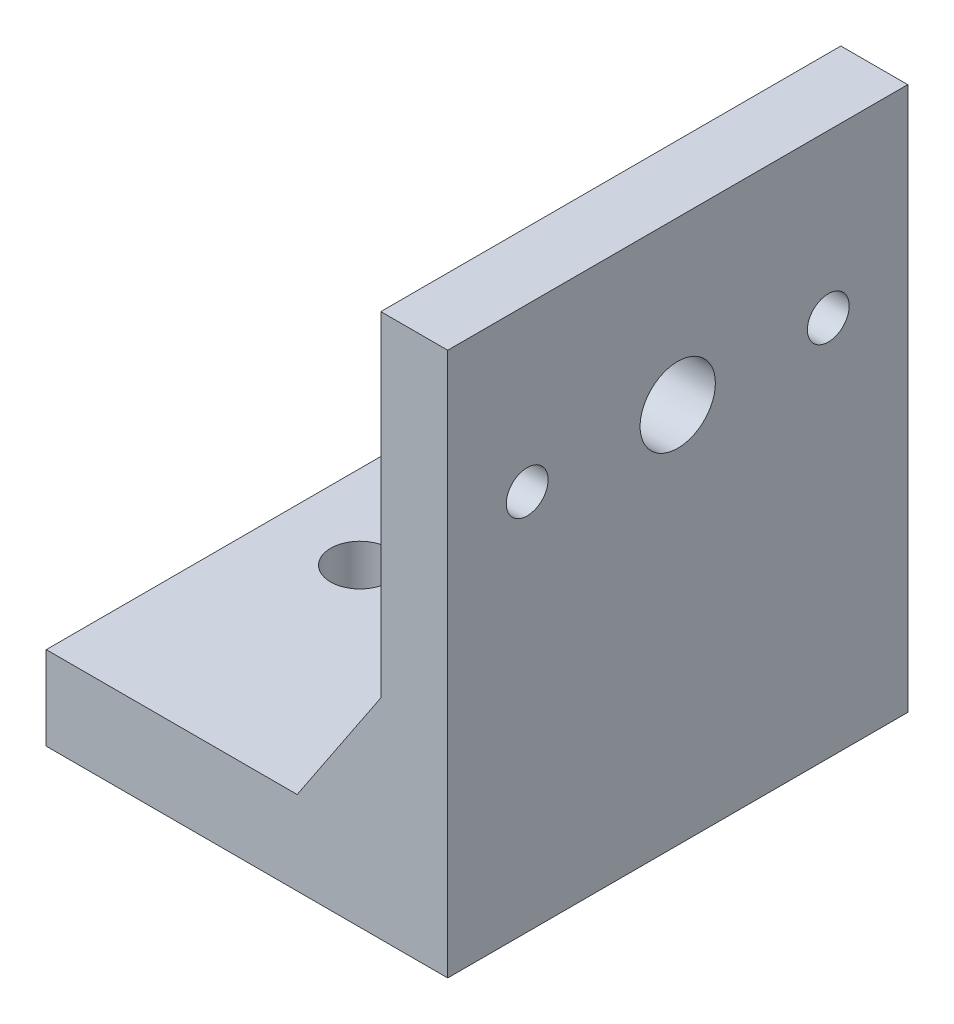
ISO-10303-21;
HEADER;
FILE_DESCRIPTION(('STEP AP214'),'2;1');
FILE_NAME('part.step','',(''),(''),'','','');
FILE_SCHEMA(('AUTOMOTIVE_DESIGN { 1 0 10303 214 1 1 1 1 }'));
ENDSEC;
DATA;
#1=APPLICATION_CONTEXT('core data for automotive mechanical design processes');
#2=APPLICATION_PROTOCOL_DEFINITION('international standard','automotive_design',2000,#1);
#3=PRODUCT_CONTEXT('',#1,'mechanical');
#4=PRODUCT('Part','Part','',(#3));
#5=PRODUCT_RELATED_PRODUCT_CATEGORY('part','',(#4));
#6=PRODUCT_DEFINITION_FORMATION('','',#4);
#7=PRODUCT_DEFINITION_CONTEXT('part definition',#1,'design');
#8=PRODUCT_DEFINITION('design','',#6,#7);
#9=PRODUCT_DEFINITION_SHAPE('','',#8);
#10=(LENGTH_UNIT() NAMED_UNIT(*) SI_UNIT(.MILLI.,.METRE.));
#11=(NAMED_UNIT(*) PLANE_ANGLE_UNIT() SI_UNIT($,.RADIAN.));
#12=(NAMED_UNIT(*) SI_UNIT($,.STERADIAN.) SOLID_ANGLE_UNIT());
#13=UNCERTAINTY_MEASURE_WITH_UNIT(LENGTH_MEASURE(1.E-05),#10,'distance_accuracy_value','');
#14=(GEOMETRIC_REPRESENTATION_CONTEXT(3) GLOBAL_UNCERTAINTY_ASSIGNED_CONTEXT((#13)) GLOBAL_UNIT_ASSIGNED_CONTEXT((#10,
#11,#12)) REPRESENTATION_CONTEXT('',''));
#15=CARTESIAN_POINT('',(0.,0.,0.));
#16=DIRECTION('',(0.,0.,1.));
#17=DIRECTION('',(1.,0.,0.));
#18=AXIS2_PLACEMENT_3D('',#15,#16,#17);
#19=CARTESIAN_POINT('',(0.,10.,0.));
#20=DIRECTION('',(0.,1.,0.));
#21=DIRECTION('',(0.,0.,1.));
#22=AXIS2_PLACEMENT_3D('',#19,#20,#21);
#23=PLANE('',#22);
#24=CARTESIAN_POINT('',(-14.,10.,0.));
#25=DIRECTION('',(0.,1.,0.));
#26=DIRECTION('',(0.,0.,1.));
#27=AXIS2_PLACEMENT_3D('',#24,#25,#26);
#28=CIRCLE('',#27,3.5);
#29=CARTESIAN_POINT('',(-14.,10.,3.5));
#30=VERTEX_POINT('',#29);
#31=EDGE_CURVE('E162',#30,#30,#28,.F.);
#32=ORIENTED_EDGE('',*,*,#31,.T.);
#33=EDGE_LOOP('',(#32));
#34=FACE_BOUND('',#33,.T.);
#35=CARTESIAN_POINT('',(4.,10.,0.));
#36=DIRECTION('',(0.,1.,0.));
#37=DIRECTION('',(0.,0.,1.));
#38=AXIS2_PLACEMENT_3D('',#35,#36,#37);
#39=CIRCLE('',#38,3.5);
#40=CARTESIAN_POINT('',(4.,10.,3.5));
#41=VERTEX_POINT('',#40);
#42=EDGE_CURVE('E157',#41,#41,#39,.F.);
#43=ORIENTED_EDGE('',*,*,#42,.T.);
#44=EDGE_LOOP('',(#43));
#45=FACE_BOUND('',#44,.T.);
#46=DIRECTION('',(1.,0.,0.));
#47=VECTOR('',#46,1.);
#48=CARTESIAN_POINT('',(-24.,10.,27.5));
#49=LINE('',#48,#47);
#50=CARTESIAN_POINT('',(-24.,10.,27.5));
#51=VERTEX_POINT('',#50);
#52=CARTESIAN_POINT('',(6.,10.,27.5));
#53=VERTEX_POINT('',#52);
#54=EDGE_CURVE('E133',#51,#53,#49,.T.);
#55=ORIENTED_EDGE('',*,*,#54,.T.);
#56=DIRECTION('',(0.,0.,1.));
#57=VECTOR('',#56,1.);
#58=CARTESIAN_POINT('',(6.,10.,22.5));
#59=LINE('',#58,#57);
#60=CARTESIAN_POINT('',(6.,10.,22.5));
#61=VERTEX_POINT('',#60);
#62=EDGE_CURVE('E125',#61,#53,#59,.T.);
#63=ORIENTED_EDGE('',*,*,#62,.F.);
#64=DIRECTION('',(-1.,0.,0.));
#65=VECTOR('',#64,1.);
#66=CARTESIAN_POINT('',(16.,10.,22.5));
#67=LINE('',#66,#65);
#68=CARTESIAN_POINT('',(16.,10.,22.5));
#69=VERTEX_POINT('',#68);
#70=EDGE_CURVE('E113',#69,#61,#67,.T.);
#71=ORIENTED_EDGE('',*,*,#70,.F.);
#72=DIRECTION('',(0.,0.,-1.));
#73=VECTOR('',#72,1.);
#74=CARTESIAN_POINT('',(16.,10.,0.));
#75=LINE('',#74,#73);
#76=CARTESIAN_POINT('',(16.,10.,-22.5));
#77=VERTEX_POINT('',#76);
#78=EDGE_CURVE('E191',#69,#77,#75,.T.);
#79=ORIENTED_EDGE('',*,*,#78,.T.);
#80=DIRECTION('',(-1.,0.,0.));
#81=VECTOR('',#80,1.);
#82=CARTESIAN_POINT('',(16.,10.,-22.5));
#83=LINE('',#82,#81);
#84=CARTESIAN_POINT('',(6.,10.,-22.5));
#85=VERTEX_POINT('',#84);
#86=EDGE_CURVE('E54',#77,#85,#83,.T.);
#87=ORIENTED_EDGE('',*,*,#86,.T.);
#88=DIRECTION('',(0.,0.,-1.));
#89=VECTOR('',#88,1.);
#90=CARTESIAN_POINT('',(6.,10.,-22.5));
#91=LINE('',#90,#89);
#92=CARTESIAN_POINT('',(6.,10.,-27.5));
#93=VERTEX_POINT('',#92);
#94=EDGE_CURVE('E58',#85,#93,#91,.T.);
#95=ORIENTED_EDGE('',*,*,#94,.T.);
#96=DIRECTION('',(-1.,0.,0.));
#97=VECTOR('',#96,1.);
#98=CARTESIAN_POINT('',(-24.,10.,-27.5));
#99=LINE('',#98,#97);
#100=CARTESIAN_POINT('',(-24.,10.,-27.5));
#101=VERTEX_POINT('',#100);
#102=EDGE_CURVE('E194',#93,#101,#99,.T.);
#103=ORIENTED_EDGE('',*,*,#102,.T.);
#104=DIRECTION('',(0.,0.,1.));
#105=VECTOR('',#104,1.);
#106=CARTESIAN_POINT('',(-24.,10.,-27.5));
#107=LINE('',#106,#105);
#108=EDGE_CURVE('E196',#101,#51,#107,.T.);
#109=ORIENTED_EDGE('',*,*,#108,.T.);
#110=EDGE_LOOP('',(#55,#63,#71,#79,#87,#95,#103,#109));
#111=FACE_BOUND('',#110,.T.);
#112=ADVANCED_FACE('F37',(#34,#45,#111),#23,.T.);
#113=CARTESIAN_POINT('',(16.,65.,-27.5));
#114=DIRECTION('',(1.,0.,0.));
#115=DIRECTION('',(0.,0.,-1.));
#116=AXIS2_PLACEMENT_3D('',#113,#114,#115);
#117=PLANE('',#116);
#118=CARTESIAN_POINT('',(16.,45.6,0.));
#119=DIRECTION('',(1.,0.,0.));
#120=DIRECTION('',(0.,0.,-1.));
#121=AXIS2_PLACEMENT_3D('',#118,#119,#120);
#122=CIRCLE('',#121,4.5);
#123=CARTESIAN_POINT('',(16.,45.6,-4.5));
#124=VERTEX_POINT('',#123);
#125=EDGE_CURVE('E175',#124,#124,#122,.T.);
#126=ORIENTED_EDGE('',*,*,#125,.T.);
#127=EDGE_LOOP('',(#126));
#128=FACE_BOUND('',#127,.T.);
#129=CARTESIAN_POINT('',(16.,45.6,-18.));
#130=DIRECTION('',(1.,0.,0.));
#131=DIRECTION('',(0.,0.,-1.));
#132=AXIS2_PLACEMENT_3D('',#129,#130,#131);
#133=CIRCLE('',#132,2.5);
#134=CARTESIAN_POINT('',(16.,45.6,-20.5));
#135=VERTEX_POINT('',#134);
#136=EDGE_CURVE('E169',#135,#135,#133,.T.);
#137=ORIENTED_EDGE('',*,*,#136,.T.);
#138=EDGE_LOOP('',(#137));
#139=FACE_BOUND('',#138,.T.);
#140=CARTESIAN_POINT('',(16.,45.6,18.));
#141=DIRECTION('',(1.,0.,0.));
#142=DIRECTION('',(0.,0.,-1.));
#143=AXIS2_PLACEMENT_3D('',#140,#141,#142);
#144=CIRCLE('',#143,2.5);
#145=CARTESIAN_POINT('',(16.,45.6,15.5));
#146=VERTEX_POINT('',#145);
#147=EDGE_CURVE('E41',#146,#146,#144,.T.);
#148=ORIENTED_EDGE('',*,*,#147,.T.);
#149=EDGE_LOOP('',(#148));
#150=FACE_BOUND('',#149,.T.);
#151=DIRECTION('',(0.,0.,1.));
#152=VECTOR('',#151,1.);
#153=CARTESIAN_POINT('',(16.,25.,22.5));
#154=LINE('',#153,#152);
#155=CARTESIAN_POINT('',(16.,25.,22.5));
#156=VERTEX_POINT('',#155);
#157=CARTESIAN_POINT('',(16.,25.,27.5));
#158=VERTEX_POINT('',#157);
#159=EDGE_CURVE('E128',#156,#158,#154,.T.);
#160=ORIENTED_EDGE('',*,*,#159,.T.);
#161=DIRECTION('',(0.,-1.,0.));
#162=VECTOR('',#161,1.);
#163=CARTESIAN_POINT('',(16.,65.,27.5));
#164=LINE('',#163,#162);
#165=CARTESIAN_POINT('',(16.,65.,27.5));
#166=VERTEX_POINT('',#165);
#167=EDGE_CURVE('E186',#166,#158,#164,.T.);
#168=ORIENTED_EDGE('',*,*,#167,.F.);
#169=DIRECTION('',(0.,0.,1.));
#170=VECTOR('',#169,1.);
#171=CARTESIAN_POINT('',(16.,65.,-27.5));
#172=LINE('',#171,#170);
#173=CARTESIAN_POINT('',(16.,65.,-27.5));
#174=VERTEX_POINT('',#173);
#175=EDGE_CURVE('E181',#174,#166,#172,.T.);
#176=ORIENTED_EDGE('',*,*,#175,.F.);
#177=DIRECTION('',(0.,-1.,0.));
#178=VECTOR('',#177,1.);
#179=CARTESIAN_POINT('',(16.,65.,-27.5));
#180=LINE('',#179,#178);
#181=CARTESIAN_POINT('',(16.,25.,-27.5));
#182=VERTEX_POINT('',#181);
#183=EDGE_CURVE('E189',#174,#182,#180,.T.);
#184=ORIENTED_EDGE('',*,*,#183,.T.);
#185=DIRECTION('',(0.,0.,-1.));
#186=VECTOR('',#185,1.);
#187=CARTESIAN_POINT('',(16.,25.,-22.5));
#188=LINE('',#187,#186);
#189=CARTESIAN_POINT('',(16.,25.,-22.5));
#190=VERTEX_POINT('',#189);
#191=EDGE_CURVE('E147',#190,#182,#188,.T.);
#192=ORIENTED_EDGE('',*,*,#191,.F.);
#193=DIRECTION('',(0.,-1.,0.));
#194=VECTOR('',#193,1.);
#195=CARTESIAN_POINT('',(16.,25.,-22.5));
#196=LINE('',#195,#194);
#197=EDGE_CURVE('E143',#190,#77,#196,.T.);
#198=ORIENTED_EDGE('',*,*,#197,.T.);
#199=ORIENTED_EDGE('',*,*,#78,.F.);
#200=DIRECTION('',(0.,-1.,0.));
#201=VECTOR('',#200,1.);
#202=CARTESIAN_POINT('',(16.,25.,22.5));
#203=LINE('',#202,#201);
#204=EDGE_CURVE('E119',#156,#69,#203,.T.);
#205=ORIENTED_EDGE('',*,*,#204,.F.);
#206=EDGE_LOOP('',(#160,#168,#176,#184,#192,#198,#199,#205));
#207=FACE_BOUND('',#206,.T.);
#208=ADVANCED_FACE('F222',(#128,#139,#150,#207),#117,.F.);
#209=CARTESIAN_POINT('',(24.,10.,-27.5));
#210=DIRECTION('',(-1.,0.,0.));
#211=DIRECTION('',(0.,0.,1.));
#212=AXIS2_PLACEMENT_3D('',#209,#210,#211);
#213=PLANE('',#212);
#214=CARTESIAN_POINT('',(24.,45.6,18.));
#215=DIRECTION('',(1.,0.,0.));
#216=DIRECTION('',(0.,0.,-1.));
#217=AXIS2_PLACEMENT_3D('',#214,#215,#216);
#218=CIRCLE('',#217,2.5);
#219=CARTESIAN_POINT('',(24.,45.6,15.5));
#220=VERTEX_POINT('',#219);
#221=EDGE_CURVE('E166',#220,#220,#218,.T.);
#222=ORIENTED_EDGE('',*,*,#221,.F.);
#223=EDGE_LOOP('',(#222));
#224=FACE_BOUND('',#223,.T.);
#225=CARTESIAN_POINT('',(24.,45.6,-18.));
#226=DIRECTION('',(1.,0.,0.));
#227=DIRECTION('',(0.,0.,1.));
#228=AXIS2_PLACEMENT_3D('',#225,#226,#227);
#229=CIRCLE('',#228,2.5);
#230=CARTESIAN_POINT('',(24.,45.6,-15.5));
#231=VERTEX_POINT('',#230);
#232=EDGE_CURVE('E165',#231,#231,#229,.T.);
#233=ORIENTED_EDGE('',*,*,#232,.F.);
#234=EDGE_LOOP('',(#233));
#235=FACE_BOUND('',#234,.T.);
#236=CARTESIAN_POINT('',(24.,45.6,0.));
#237=DIRECTION('',(1.,0.,0.));
#238=DIRECTION('',(0.,0.,-1.));
#239=AXIS2_PLACEMENT_3D('',#236,#237,#238);
#240=CIRCLE('',#239,4.5);
#241=CARTESIAN_POINT('',(24.,45.6,-4.5));
#242=VERTEX_POINT('',#241);
#243=EDGE_CURVE('E172',#242,#242,#240,.T.);
#244=ORIENTED_EDGE('',*,*,#243,.F.);
#245=EDGE_LOOP('',(#244));
#246=FACE_BOUND('',#245,.T.);
#247=DIRECTION('',(0.,0.,-1.));
#248=VECTOR('',#247,1.);
#249=CARTESIAN_POINT('',(24.,0.,-27.5));
#250=LINE('',#249,#248);
#251=CARTESIAN_POINT('',(24.,0.,27.5));
#252=VERTEX_POINT('',#251);
#253=CARTESIAN_POINT('',(24.,0.,-27.5));
#254=VERTEX_POINT('',#253);
#255=EDGE_CURVE('E193',#252,#254,#250,.T.);
#256=ORIENTED_EDGE('',*,*,#255,.T.);
#257=DIRECTION('',(0.,-1.,0.));
#258=VECTOR('',#257,1.);
#259=CARTESIAN_POINT('',(24.,10.,-27.5));
#260=LINE('',#259,#258);
#261=CARTESIAN_POINT('',(24.,65.,-27.5));
#262=VERTEX_POINT('',#261);
#263=EDGE_CURVE('E11',#262,#254,#260,.T.);
#264=ORIENTED_EDGE('',*,*,#263,.F.);
#265=DIRECTION('',(0.,0.,-1.));
#266=VECTOR('',#265,1.);
#267=CARTESIAN_POINT('',(24.,65.,-27.5));
#268=LINE('',#267,#266);
#269=CARTESIAN_POINT('',(24.,65.,27.5));
#270=VERTEX_POINT('',#269);
#271=EDGE_CURVE('E176',#270,#262,#268,.T.);
#272=ORIENTED_EDGE('',*,*,#271,.F.);
#273=DIRECTION('',(0.,-1.,0.));
#274=VECTOR('',#273,1.);
#275=CARTESIAN_POINT('',(24.,10.,27.5));
#276=LINE('',#275,#274);
#277=EDGE_CURVE('E200',#270,#252,#276,.T.);
#278=ORIENTED_EDGE('',*,*,#277,.T.);
#279=EDGE_LOOP('',(#256,#264,#272,#278));
#280=FACE_BOUND('',#279,.T.);
#281=ADVANCED_FACE('F39',(#224,#235,#246,#280),#213,.F.);
#282=CARTESIAN_POINT('',(-24.,10.,-27.5));
#283=DIRECTION('',(0.,0.,1.));
#284=DIRECTION('',(1.,0.,0.));
#285=AXIS2_PLACEMENT_3D('',#282,#283,#284);
#286=PLANE('',#285);
#287=ORIENTED_EDGE('',*,*,#102,.F.);
#288=DIRECTION('',(0.554700196225229,0.832050294337844,0.));
#289=VECTOR('',#288,1.);
#290=CARTESIAN_POINT('',(16.,25.,-27.5));
#291=LINE('',#290,#289);
#292=EDGE_CURVE('E135',#93,#182,#291,.T.);
#293=ORIENTED_EDGE('',*,*,#292,.T.);
#294=ORIENTED_EDGE('',*,*,#183,.F.);
#295=DIRECTION('',(-1.,0.,0.));
#296=VECTOR('',#295,1.);
#297=CARTESIAN_POINT('',(24.,65.,-27.5));
#298=LINE('',#297,#296);
#299=EDGE_CURVE('E179',#262,#174,#298,.T.);
#300=ORIENTED_EDGE('',*,*,#299,.F.);
#301=ORIENTED_EDGE('',*,*,#263,.T.);
#302=DIRECTION('',(-1.,0.,0.));
#303=VECTOR('',#302,1.);
#304=CARTESIAN_POINT('',(-24.,0.,-27.5));
#305=LINE('',#304,#303);
#306=CARTESIAN_POINT('',(-24.,0.,-27.5));
#307=VERTEX_POINT('',#306);
#308=EDGE_CURVE('E203',#254,#307,#305,.T.);
#309=ORIENTED_EDGE('',*,*,#308,.T.);
#310=DIRECTION('',(0.,-1.,0.));
#311=VECTOR('',#310,1.);
#312=CARTESIAN_POINT('',(-24.,10.,-27.5));
#313=LINE('',#312,#311);
#314=EDGE_CURVE('E46',#101,#307,#313,.T.);
#315=ORIENTED_EDGE('',*,*,#314,.F.);
#316=EDGE_LOOP('',(#287,#293,#294,#300,#301,#309,#315));
#317=FACE_BOUND('',#316,.T.);
#318=ADVANCED_FACE('F263',(#317),#286,.F.);
#319=CARTESIAN_POINT('',(-24.,10.,-27.5));
#320=DIRECTION('',(1.,0.,0.));
#321=DIRECTION('',(0.,0.,-1.));
#322=AXIS2_PLACEMENT_3D('',#319,#320,#321);
#323=PLANE('',#322);
#324=DIRECTION('',(0.,0.,1.));
#325=VECTOR('',#324,1.);
#326=CARTESIAN_POINT('',(-24.,0.,-27.5));
#327=LINE('',#326,#325);
#328=CARTESIAN_POINT('',(-24.,0.,27.5));
#329=VERTEX_POINT('',#328);
#330=EDGE_CURVE('E205',#307,#329,#327,.T.);
#331=ORIENTED_EDGE('',*,*,#330,.T.);
#332=DIRECTION('',(0.,-1.,0.));
#333=VECTOR('',#332,1.);
#334=CARTESIAN_POINT('',(-24.,10.,27.5));
#335=LINE('',#334,#333);
#336=EDGE_CURVE('E210',#51,#329,#335,.T.);
#337=ORIENTED_EDGE('',*,*,#336,.F.);
#338=ORIENTED_EDGE('',*,*,#108,.F.);
#339=ORIENTED_EDGE('',*,*,#314,.T.);
#340=EDGE_LOOP('',(#331,#337,#338,#339));
#341=FACE_BOUND('',#340,.T.);
#342=ADVANCED_FACE('F260',(#341),#323,.F.);
#343=CARTESIAN_POINT('',(-24.,10.,27.5));
#344=DIRECTION('',(0.,0.,-1.));
#345=DIRECTION('',(-1.,0.,0.));
#346=AXIS2_PLACEMENT_3D('',#343,#344,#345);
#347=PLANE('',#346);
#348=DIRECTION('',(0.554700196225229,0.832050294337844,0.));
#349=VECTOR('',#348,1.);
#350=CARTESIAN_POINT('',(16.,25.,27.5));
#351=LINE('',#350,#349);
#352=EDGE_CURVE('E129',#53,#158,#351,.T.);
#353=ORIENTED_EDGE('',*,*,#352,.F.);
#354=ORIENTED_EDGE('',*,*,#54,.F.);
#355=ORIENTED_EDGE('',*,*,#336,.T.);
#356=DIRECTION('',(1.,0.,0.));
#357=VECTOR('',#356,1.);
#358=CARTESIAN_POINT('',(-24.,0.,27.5));
#359=LINE('',#358,#357);
#360=EDGE_CURVE('E197',#329,#252,#359,.T.);
#361=ORIENTED_EDGE('',*,*,#360,.T.);
#362=ORIENTED_EDGE('',*,*,#277,.F.);
#363=DIRECTION('',(1.,0.,0.));
#364=VECTOR('',#363,1.);
#365=CARTESIAN_POINT('',(24.,65.,27.5));
#366=LINE('',#365,#364);
#367=EDGE_CURVE('E183',#166,#270,#366,.T.);
#368=ORIENTED_EDGE('',*,*,#367,.F.);
#369=ORIENTED_EDGE('',*,*,#167,.T.);
#370=EDGE_LOOP('',(#353,#354,#355,#361,#362,#368,#369));
#371=FACE_BOUND('',#370,.T.);
#372=ADVANCED_FACE('F256',(#371),#347,.F.);
#373=CARTESIAN_POINT('',(0.,0.,0.));
#374=DIRECTION('',(0.,1.,0.));
#375=DIRECTION('',(0.,0.,1.));
#376=AXIS2_PLACEMENT_3D('',#373,#374,#375);
#377=PLANE('',#376);
#378=CARTESIAN_POINT('',(-14.,0.,0.));
#379=DIRECTION('',(0.,1.,0.));
#380=DIRECTION('',(0.,0.,1.));
#381=AXIS2_PLACEMENT_3D('',#378,#379,#380);
#382=CIRCLE('',#381,3.5);
#383=CARTESIAN_POINT('',(-14.,0.,3.5));
#384=VERTEX_POINT('',#383);
#385=EDGE_CURVE('E154',#384,#384,#382,.T.);
#386=ORIENTED_EDGE('',*,*,#385,.T.);
#387=EDGE_LOOP('',(#386));
#388=FACE_BOUND('',#387,.T.);
#389=CARTESIAN_POINT('',(4.,0.,0.));
#390=DIRECTION('',(0.,1.,0.));
#391=DIRECTION('',(0.,0.,1.));
#392=AXIS2_PLACEMENT_3D('',#389,#390,#391);
#393=CIRCLE('',#392,3.5);
#394=CARTESIAN_POINT('',(4.,0.,3.5));
#395=VERTEX_POINT('',#394);
#396=EDGE_CURVE('E151',#395,#395,#393,.T.);
#397=ORIENTED_EDGE('',*,*,#396,.T.);
#398=EDGE_LOOP('',(#397));
#399=FACE_BOUND('',#398,.T.);
#400=ORIENTED_EDGE('',*,*,#255,.F.);
#401=ORIENTED_EDGE('',*,*,#360,.F.);
#402=ORIENTED_EDGE('',*,*,#330,.F.);
#403=ORIENTED_EDGE('',*,*,#308,.F.);
#404=EDGE_LOOP('',(#400,#401,#402,#403));
#405=FACE_BOUND('',#404,.T.);
#406=ADVANCED_FACE('F252',(#388,#399,#405),#377,.F.);
#407=CARTESIAN_POINT('',(0.,65.,0.));
#408=DIRECTION('',(0.,-1.,0.));
#409=DIRECTION('',(0.,0.,-1.));
#410=AXIS2_PLACEMENT_3D('',#407,#408,#409);
#411=PLANE('',#410);
#412=ORIENTED_EDGE('',*,*,#271,.T.);
#413=ORIENTED_EDGE('',*,*,#299,.T.);
#414=ORIENTED_EDGE('',*,*,#175,.T.);
#415=ORIENTED_EDGE('',*,*,#367,.T.);
#416=EDGE_LOOP('',(#412,#413,#414,#415));
#417=FACE_BOUND('',#416,.T.);
#418=ADVANCED_FACE('F255',(#417),#411,.F.);
#419=CARTESIAN_POINT('',(-41.,45.6,0.));
#420=DIRECTION('',(1.,0.,0.));
#421=DIRECTION('',(0.,0.,-1.));
#422=AXIS2_PLACEMENT_3D('',#419,#420,#421);
#423=CYLINDRICAL_SURFACE('',#422,4.5);
#424=ORIENTED_EDGE('',*,*,#243,.T.);
#425=EDGE_LOOP('',(#424));
#426=FACE_BOUND('',#425,.T.);
#427=ORIENTED_EDGE('',*,*,#125,.F.);
#428=EDGE_LOOP('',(#427));
#429=FACE_BOUND('',#428,.T.);
#430=ADVANCED_FACE('F238',(#426,#429),#423,.F.);
#431=CARTESIAN_POINT('',(-41.,45.6,-18.));
#432=DIRECTION('',(1.,0.,0.));
#433=DIRECTION('',(0.,0.,-1.));
#434=AXIS2_PLACEMENT_3D('',#431,#432,#433);
#435=CYLINDRICAL_SURFACE('',#434,2.5);
#436=ORIENTED_EDGE('',*,*,#232,.T.);
#437=EDGE_LOOP('',(#436));
#438=FACE_BOUND('',#437,.T.);
#439=ORIENTED_EDGE('',*,*,#136,.F.);
#440=EDGE_LOOP('',(#439));
#441=FACE_BOUND('',#440,.T.);
#442=ADVANCED_FACE('F228',(#438,#441),#435,.F.);
#443=CARTESIAN_POINT('',(-41.,45.6,18.));
#444=DIRECTION('',(1.,0.,0.));
#445=DIRECTION('',(0.,0.,-1.));
#446=AXIS2_PLACEMENT_3D('',#443,#444,#445);
#447=CYLINDRICAL_SURFACE('',#446,2.5);
#448=ORIENTED_EDGE('',*,*,#221,.T.);
#449=EDGE_LOOP('',(#448));
#450=FACE_BOUND('',#449,.T.);
#451=ORIENTED_EDGE('',*,*,#147,.F.);
#452=EDGE_LOOP('',(#451));
#453=FACE_BOUND('',#452,.T.);
#454=ADVANCED_FACE('F225',(#450,#453),#447,.F.);
#455=CARTESIAN_POINT('',(4.,65.,0.));
#456=DIRECTION('',(0.,-1.,0.));
#457=DIRECTION('',(0.,0.,-1.));
#458=AXIS2_PLACEMENT_3D('',#455,#456,#457);
#459=CYLINDRICAL_SURFACE('',#458,3.5);
#460=ORIENTED_EDGE('',*,*,#42,.F.);
#461=EDGE_LOOP('',(#460));
#462=FACE_BOUND('',#461,.T.);
#463=ORIENTED_EDGE('',*,*,#396,.F.);
#464=EDGE_LOOP('',(#463));
#465=FACE_BOUND('',#464,.T.);
#466=ADVANCED_FACE('F227',(#462,#465),#459,.F.);
#467=CARTESIAN_POINT('',(-14.,65.,0.));
#468=DIRECTION('',(0.,-1.,0.));
#469=DIRECTION('',(0.,0.,-1.));
#470=AXIS2_PLACEMENT_3D('',#467,#468,#469);
#471=CYLINDRICAL_SURFACE('',#470,3.5);
#472=ORIENTED_EDGE('',*,*,#31,.F.);
#473=EDGE_LOOP('',(#472));
#474=FACE_BOUND('',#473,.T.);
#475=ORIENTED_EDGE('',*,*,#385,.F.);
#476=EDGE_LOOP('',(#475));
#477=FACE_BOUND('',#476,.T.);
#478=ADVANCED_FACE('F235',(#474,#477),#471,.F.);
#479=CARTESIAN_POINT('',(16.,25.,-22.5));
#480=DIRECTION('',(-0.832050294337844,0.554700196225229,0.));
#481=DIRECTION('',(-0.554700196225229,-0.832050294337844,0.));
#482=AXIS2_PLACEMENT_3D('',#479,#480,#481);
#483=PLANE('',#482);
#484=ORIENTED_EDGE('',*,*,#292,.F.);
#485=ORIENTED_EDGE('',*,*,#94,.F.);
#486=DIRECTION('',(0.554700196225229,0.832050294337844,0.));
#487=VECTOR('',#486,1.);
#488=CARTESIAN_POINT('',(16.,25.,-22.5));
#489=LINE('',#488,#487);
#490=EDGE_CURVE('E140',#85,#190,#489,.T.);
#491=ORIENTED_EDGE('',*,*,#490,.T.);
#492=ORIENTED_EDGE('',*,*,#191,.T.);
#493=EDGE_LOOP('',(#484,#485,#491,#492));
#494=FACE_BOUND('',#493,.T.);
#495=ADVANCED_FACE('F276',(#494),#483,.T.);
#496=CARTESIAN_POINT('',(0.,0.,-22.5));
#497=DIRECTION('',(0.,0.,-1.));
#498=DIRECTION('',(-1.,0.,0.));
#499=AXIS2_PLACEMENT_3D('',#496,#497,#498);
#500=PLANE('',#499);
#501=ORIENTED_EDGE('',*,*,#490,.F.);
#502=ORIENTED_EDGE('',*,*,#86,.F.);
#503=ORIENTED_EDGE('',*,*,#197,.F.);
#504=EDGE_LOOP('',(#501,#502,#503));
#505=FACE_BOUND('',#504,.T.);
#506=ADVANCED_FACE('F281',(#505),#500,.F.);
#507=CARTESIAN_POINT('',(16.,25.,22.5));
#508=DIRECTION('',(0.832050294337844,-0.554700196225229,0.));
#509=DIRECTION('',(0.554700196225229,0.832050294337844,0.));
#510=AXIS2_PLACEMENT_3D('',#507,#508,#509);
#511=PLANE('',#510);
#512=ORIENTED_EDGE('',*,*,#352,.T.);
#513=ORIENTED_EDGE('',*,*,#159,.F.);
#514=DIRECTION('',(0.554700196225229,0.832050294337844,0.));
#515=VECTOR('',#514,1.);
#516=CARTESIAN_POINT('',(16.,25.,22.5));
#517=LINE('',#516,#515);
#518=EDGE_CURVE('E116',#61,#156,#517,.T.);
#519=ORIENTED_EDGE('',*,*,#518,.F.);
#520=ORIENTED_EDGE('',*,*,#62,.T.);
#521=EDGE_LOOP('',(#512,#513,#519,#520));
#522=FACE_BOUND('',#521,.T.);
#523=ADVANCED_FACE('F124',(#522),#511,.F.);
#524=CARTESIAN_POINT('',(0.,0.,22.5));
#525=DIRECTION('',(0.,0.,1.));
#526=DIRECTION('',(-1.,0.,0.));
#527=AXIS2_PLACEMENT_3D('',#524,#525,#526);
#528=PLANE('',#527);
#529=ORIENTED_EDGE('',*,*,#518,.T.);
#530=ORIENTED_EDGE('',*,*,#204,.T.);
#531=ORIENTED_EDGE('',*,*,#70,.T.);
#532=EDGE_LOOP('',(#529,#530,#531));
#533=FACE_BOUND('',#532,.T.);
#534=ADVANCED_FACE('F115',(#533),#528,.F.);
#535=CLOSED_SHELL('',(#112,#208,#281,#318,#342,#372,#406,#418,#430,#442,#454,#466,#478,#495,
#506,#523,#534));
#536=MANIFOLD_SOLID_BREP('B2',#535);
#537=ADVANCED_BREP_SHAPE_REPRESENTATION('',(#18,#536),#14);
#538=SHAPE_DEFINITION_REPRESENTATION(#9,#537);
ENDSEC;
END-ISO-10303-21;
